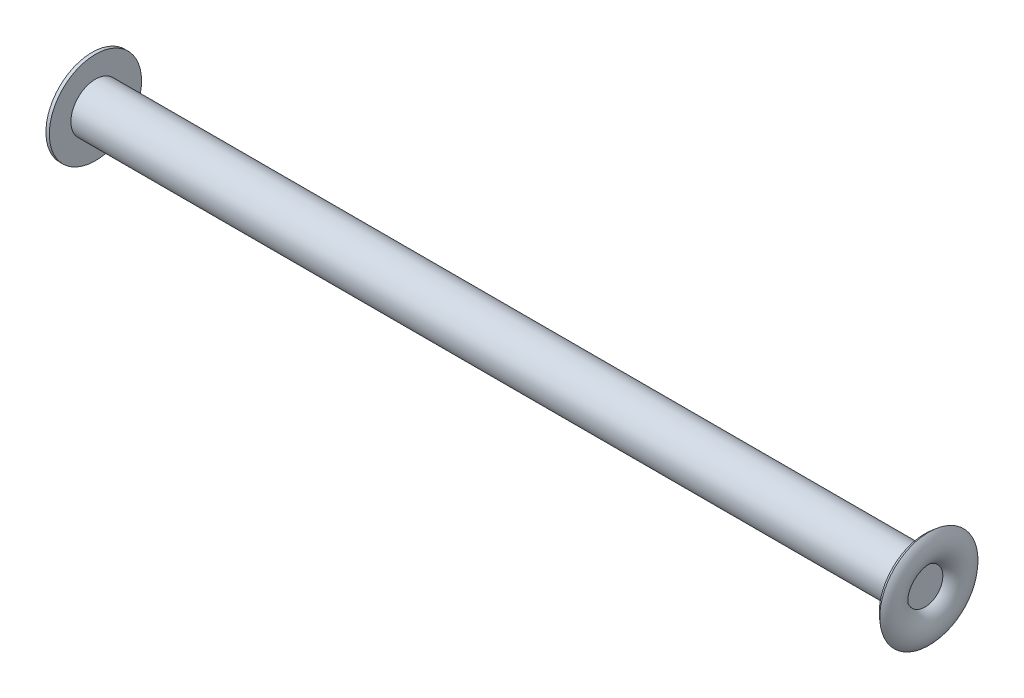
ISO-10303-21;
HEADER;
FILE_DESCRIPTION(('STEP AP214'),'2;1');
FILE_NAME('part.step','',(''),(''),'','','');
FILE_SCHEMA(('AUTOMOTIVE_DESIGN { 1 0 10303 214 1 1 1 1 }'));
ENDSEC;
DATA;
#1=APPLICATION_CONTEXT('core data for automotive mechanical design processes');
#2=APPLICATION_PROTOCOL_DEFINITION('international standard','automotive_design',2000,#1);
#3=PRODUCT_CONTEXT('',#1,'mechanical');
#4=PRODUCT('Part','Part','',(#3));
#5=PRODUCT_RELATED_PRODUCT_CATEGORY('part','',(#4));
#6=PRODUCT_DEFINITION_FORMATION('','',#4);
#7=PRODUCT_DEFINITION_CONTEXT('part definition',#1,'design');
#8=PRODUCT_DEFINITION('design','',#6,#7);
#9=PRODUCT_DEFINITION_SHAPE('','',#8);
#10=(LENGTH_UNIT() NAMED_UNIT(*) SI_UNIT(.MILLI.,.METRE.));
#11=(NAMED_UNIT(*) PLANE_ANGLE_UNIT() SI_UNIT($,.RADIAN.));
#12=(NAMED_UNIT(*) SI_UNIT($,.STERADIAN.) SOLID_ANGLE_UNIT());
#13=UNCERTAINTY_MEASURE_WITH_UNIT(LENGTH_MEASURE(1.E-05),#10,'distance_accuracy_value','');
#14=(GEOMETRIC_REPRESENTATION_CONTEXT(3) GLOBAL_UNCERTAINTY_ASSIGNED_CONTEXT((#13)) GLOBAL_UNIT_ASSIGNED_CONTEXT((#10,
#11,#12)) REPRESENTATION_CONTEXT('',''));
#15=CARTESIAN_POINT('',(0.,0.,0.));
#16=DIRECTION('',(0.,0.,1.));
#17=DIRECTION('',(1.,0.,0.));
#18=AXIS2_PLACEMENT_3D('',#15,#16,#17);
#19=CARTESIAN_POINT('',(49.784,0.,0.));
#20=DIRECTION('',(1.,0.,0.));
#21=DIRECTION('',(0.,0.,-1.));
#22=AXIS2_PLACEMENT_3D('',#19,#20,#21);
#23=PLANE('',#22);
#24=CARTESIAN_POINT('',(49.784,0.,0.));
#25=DIRECTION('',(1.,0.,0.));
#26=DIRECTION('',(0.,0.,-1.));
#27=AXIS2_PLACEMENT_3D('',#24,#25,#26);
#28=CIRCLE('',#27,1.07585685002164);
#29=CARTESIAN_POINT('',(49.784,0.,-1.07585685002164));
#30=VERTEX_POINT('',#29);
#31=EDGE_CURVE('E42',#30,#30,#28,.F.);
#32=ORIENTED_EDGE('',*,*,#31,.F.);
#33=EDGE_LOOP('',(#32));
#34=FACE_BOUND('',#33,.T.);
#35=ADVANCED_FACE('F17',(#34),#23,.T.);
#36=CARTESIAN_POINT('',(-0.9144,0.,0.));
#37=DIRECTION('',(-1.,0.,0.));
#38=DIRECTION('',(0.,0.,1.));
#39=AXIS2_PLACEMENT_3D('',#36,#37,#38);
#40=PLANE('',#39);
#41=CARTESIAN_POINT('',(-0.914399999999999,0.,0.));
#42=DIRECTION('',(1.,0.,0.));
#43=DIRECTION('',(0.,0.,-1.));
#44=AXIS2_PLACEMENT_3D('',#41,#42,#43);
#45=CIRCLE('',#44,0.0898598239255418);
#46=CARTESIAN_POINT('',(-0.9144,0.,-0.0898598239255401));
#47=VERTEX_POINT('',#46);
#48=CARTESIAN_POINT('',(-0.9144,0.,0.0898598239255401));
#49=VERTEX_POINT('',#48);
#50=EDGE_CURVE('E34',#47,#49,#45,.T.);
#51=ORIENTED_EDGE('',*,*,#50,.F.);
#52=CARTESIAN_POINT('',(-0.914399999999999,0.,0.));
#53=DIRECTION('',(1.,0.,0.));
#54=DIRECTION('',(0.,0.,1.));
#55=AXIS2_PLACEMENT_3D('',#52,#53,#54);
#56=CIRCLE('',#55,0.0898598239255418);
#57=EDGE_CURVE('E40',#49,#47,#56,.T.);
#58=ORIENTED_EDGE('',*,*,#57,.F.);
#59=EDGE_LOOP('',(#51,#58));
#60=FACE_BOUND('',#59,.T.);
#61=ADVANCED_FACE('F45',(#60),#40,.T.);
#62=CARTESIAN_POINT('',(49.149,0.,0.));
#63=DIRECTION('',(1.,0.,0.));
#64=DIRECTION('',(0.,0.,-1.));
#65=AXIS2_PLACEMENT_3D('',#62,#63,#64);
#66=TOROIDAL_SURFACE('',#65,2.1082,1.21200551950362);
#67=ORIENTED_EDGE('',*,*,#31,.T.);
#68=EDGE_LOOP('',(#67));
#69=FACE_BOUND('',#68,.T.);
#70=CARTESIAN_POINT('',(50.0244222242827,0.,0.));
#71=DIRECTION('',(1.,0.,0.));
#72=DIRECTION('',(0.,0.,-1.));
#73=AXIS2_PLACEMENT_3D('',#70,#71,#72);
#74=CIRCLE('',#73,2.94640839206295);
#75=CARTESIAN_POINT('',(50.0244222242827,0.,-2.94640839206295));
#76=VERTEX_POINT('',#75);
#77=EDGE_CURVE('E46',#76,#76,#74,.F.);
#78=ORIENTED_EDGE('',*,*,#77,.F.);
#79=EDGE_LOOP('',(#78));
#80=FACE_BOUND('',#79,.T.);
#81=ADVANCED_FACE('F62',(#69,#80),#66,.T.);
#82=CARTESIAN_POINT('',(4.82935854520074,0.,0.0013150851120964));
#83=DIRECTION('',(0.,1.,0.));
#84=DIRECTION('',(0.,0.,-1.));
#85=AXIS2_PLACEMENT_3D('',#82,#83,#84);
#86=CIRCLE('',#85,5.74448214285714);
#87=TRIMMED_CURVE('',#86,(PARAMETER_VALUE(-1.570567396651)),(PARAMETER_VALUE(1.570567396651)),
.T.,.PARAMETER.);
#88=CARTESIAN_POINT('',(4.82935854520074,0.,0.));
#89=DIRECTION('',(1.,0.,0.));
#90=AXIS1_PLACEMENT('',#88,#89);
#91=SURFACE_OF_REVOLUTION('',#87,#90);
#92=ORIENTED_EDGE('',*,*,#50,.T.);
#93=ORIENTED_EDGE('',*,*,#57,.T.);
#94=EDGE_LOOP('',(#92,#93));
#95=FACE_BOUND('',#94,.T.);
#96=CARTESIAN_POINT('',(-0.2032,0.,0.));
#97=DIRECTION('',(1.,0.,0.));
#98=DIRECTION('',(0.,0.,-1.));
#99=AXIS2_PLACEMENT_3D('',#96,#97,#98);
#100=CIRCLE('',#99,2.7686);
#101=CARTESIAN_POINT('',(-0.2032,0.,-2.7686));
#102=VERTEX_POINT('',#101);
#103=EDGE_CURVE('E73',#102,#102,#100,.T.);
#104=ORIENTED_EDGE('',*,*,#103,.F.);
#105=EDGE_LOOP('',(#104));
#106=FACE_BOUND('',#105,.T.);
#107=ADVANCED_FACE('F38',(#95,#106),#91,.F.);
#108=CARTESIAN_POINT('',(50.0244222242259,0.,0.));
#109=DIRECTION('',(1.,0.,0.));
#110=DIRECTION('',(0.,1.,0.));
#111=AXIS2_PLACEMENT_3D('',#108,#109,#110);
#112=CONICAL_SURFACE('',#111,2.94640839200611,0.701709367526113);
#113=ORIENTED_EDGE('',*,*,#77,.T.);
#114=EDGE_LOOP('',(#113));
#115=FACE_BOUND('',#114,.T.);
#116=CARTESIAN_POINT('',(49.784,0.,0.));
#117=DIRECTION('',(1.,0.,0.));
#118=DIRECTION('',(0.,0.,-1.));
#119=AXIS2_PLACEMENT_3D('',#116,#117,#118);
#120=CIRCLE('',#119,2.7432);
#121=CARTESIAN_POINT('',(49.784,0.,-2.7432));
#122=VERTEX_POINT('',#121);
#123=EDGE_CURVE('E78',#122,#122,#120,.T.);
#124=ORIENTED_EDGE('',*,*,#123,.T.);
#125=EDGE_LOOP('',(#124));
#126=FACE_BOUND('',#125,.T.);
#127=ADVANCED_FACE('F94',(#115,#126),#112,.T.);
#128=CARTESIAN_POINT('',(-0.9144,0.,0.));
#129=DIRECTION('',(1.,0.,0.));
#130=DIRECTION('',(0.,0.,-1.));
#131=AXIS2_PLACEMENT_3D('',#128,#129,#130);
#132=CYLINDRICAL_SURFACE('',#131,2.7686);
#133=ORIENTED_EDGE('',*,*,#103,.T.);
#134=EDGE_LOOP('',(#133));
#135=FACE_BOUND('',#134,.T.);
#136=CARTESIAN_POINT('',(0.,0.,0.));
#137=DIRECTION('',(1.,0.,0.));
#138=DIRECTION('',(0.,0.,-1.));
#139=AXIS2_PLACEMENT_3D('',#136,#137,#138);
#140=CIRCLE('',#139,2.7686);
#141=CARTESIAN_POINT('',(0.,0.,-2.7686));
#142=VERTEX_POINT('',#141);
#143=EDGE_CURVE('E81',#142,#142,#140,.F.);
#144=ORIENTED_EDGE('',*,*,#143,.T.);
#145=EDGE_LOOP('',(#144));
#146=FACE_BOUND('',#145,.T.);
#147=ADVANCED_FACE('F90',(#135,#146),#132,.T.);
#148=CARTESIAN_POINT('',(49.149,0.,0.));
#149=DIRECTION('',(1.,0.,0.));
#150=DIRECTION('',(0.,0.,-1.));
#151=AXIS2_PLACEMENT_3D('',#148,#149,#150);
#152=TOROIDAL_SURFACE('',#151,2.1082,0.898025612106913);
#153=ORIENTED_EDGE('',*,*,#123,.F.);
#154=EDGE_LOOP('',(#153));
#155=FACE_BOUND('',#154,.T.);
#156=CARTESIAN_POINT('',(49.784,0.,0.));
#157=DIRECTION('',(-1.,0.,0.));
#158=DIRECTION('',(0.,0.,1.));
#159=AXIS2_PLACEMENT_3D('',#156,#157,#158);
#160=CIRCLE('',#159,1.4732);
#161=CARTESIAN_POINT('',(49.784,0.,1.4732));
#162=VERTEX_POINT('',#161);
#163=EDGE_CURVE('E27',#162,#162,#160,.T.);
#164=ORIENTED_EDGE('',*,*,#163,.F.);
#165=EDGE_LOOP('',(#164));
#166=FACE_BOUND('',#165,.T.);
#167=ADVANCED_FACE('F85',(#155,#166),#152,.F.);
#168=CARTESIAN_POINT('',(0.,0.,0.));
#169=DIRECTION('',(-1.,0.,0.));
#170=DIRECTION('',(0.,0.,1.));
#171=AXIS2_PLACEMENT_3D('',#168,#169,#170);
#172=PLANE('',#171);
#173=CARTESIAN_POINT('',(0.,0.,0.));
#174=DIRECTION('',(-1.,0.,0.));
#175=DIRECTION('',(0.,0.,1.));
#176=AXIS2_PLACEMENT_3D('',#173,#174,#175);
#177=CIRCLE('',#176,1.4732);
#178=CARTESIAN_POINT('',(0.,0.,1.4732));
#179=VERTEX_POINT('',#178);
#180=EDGE_CURVE('E11',#179,#179,#177,.F.);
#181=ORIENTED_EDGE('',*,*,#180,.F.);
#182=EDGE_LOOP('',(#181));
#183=FACE_BOUND('',#182,.T.);
#184=ORIENTED_EDGE('',*,*,#143,.F.);
#185=EDGE_LOOP('',(#184));
#186=FACE_BOUND('',#185,.T.);
#187=ADVANCED_FACE('F89',(#183,#186),#172,.F.);
#188=CARTESIAN_POINT('',(49.784,0.,0.));
#189=DIRECTION('',(-1.,0.,0.));
#190=DIRECTION('',(0.,0.,1.));
#191=AXIS2_PLACEMENT_3D('',#188,#189,#190);
#192=CYLINDRICAL_SURFACE('',#191,1.4732);
#193=ORIENTED_EDGE('',*,*,#180,.T.);
#194=EDGE_LOOP('',(#193));
#195=FACE_BOUND('',#194,.T.);
#196=ORIENTED_EDGE('',*,*,#163,.T.);
#197=EDGE_LOOP('',(#196));
#198=FACE_BOUND('',#197,.T.);
#199=ADVANCED_FACE('F103',(#195,#198),#192,.T.);
#200=CLOSED_SHELL('',(#35,#61,#81,#107,#127,#147,#167,#187,#199));
#201=MANIFOLD_SOLID_BREP('B1',#200);
#202=ADVANCED_BREP_SHAPE_REPRESENTATION('',(#18,#201),#14);
#203=SHAPE_DEFINITION_REPRESENTATION(#9,#202);
ENDSEC;
END-ISO-10303-21;
